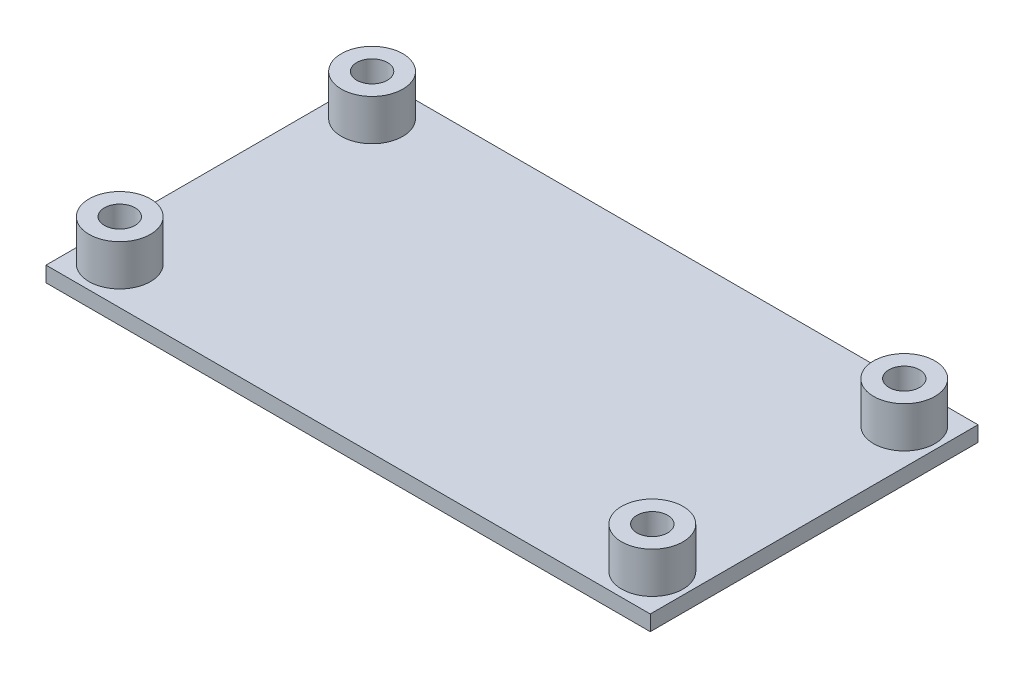
ISO-10303-21;
HEADER;
FILE_DESCRIPTION(('STEP AP214'),'2;1');
FILE_NAME('part.step','',(''),(''),'','','');
FILE_SCHEMA(('AUTOMOTIVE_DESIGN { 1 0 10303 214 1 1 1 1 }'));
ENDSEC;
DATA;
#1=APPLICATION_CONTEXT('core data for automotive mechanical design processes');
#2=APPLICATION_PROTOCOL_DEFINITION('international standard','automotive_design',2000,#1);
#3=PRODUCT_CONTEXT('',#1,'mechanical');
#4=PRODUCT('Part','Part','',(#3));
#5=PRODUCT_RELATED_PRODUCT_CATEGORY('part','',(#4));
#6=PRODUCT_DEFINITION_FORMATION('','',#4);
#7=PRODUCT_DEFINITION_CONTEXT('part definition',#1,'design');
#8=PRODUCT_DEFINITION('design','',#6,#7);
#9=PRODUCT_DEFINITION_SHAPE('','',#8);
#10=(LENGTH_UNIT() NAMED_UNIT(*) SI_UNIT(.MILLI.,.METRE.));
#11=(NAMED_UNIT(*) PLANE_ANGLE_UNIT() SI_UNIT($,.RADIAN.));
#12=(NAMED_UNIT(*) SI_UNIT($,.STERADIAN.) SOLID_ANGLE_UNIT());
#13=UNCERTAINTY_MEASURE_WITH_UNIT(LENGTH_MEASURE(1.E-05),#10,'distance_accuracy_value','');
#14=(GEOMETRIC_REPRESENTATION_CONTEXT(3) GLOBAL_UNCERTAINTY_ASSIGNED_CONTEXT((#13)) GLOBAL_UNIT_ASSIGNED_CONTEXT((#10,
#11,#12)) REPRESENTATION_CONTEXT('',''));
#15=CARTESIAN_POINT('',(0.,0.,0.));
#16=DIRECTION('',(0.,0.,1.));
#17=DIRECTION('',(1.,0.,0.));
#18=AXIS2_PLACEMENT_3D('',#15,#16,#17);
#19=CARTESIAN_POINT('',(0.,1.5,0.));
#20=DIRECTION('',(0.,1.,0.));
#21=DIRECTION('',(0.,0.,1.));
#22=AXIS2_PLACEMENT_3D('',#19,#20,#21);
#23=PLANE('',#22);
#24=DIRECTION('',(0.,0.,-1.));
#25=VECTOR('',#24,1.);
#26=CARTESIAN_POINT('',(33.3618988565565,1.5,-11.4656738072446));
#27=LINE('',#26,#25);
#28=CARTESIAN_POINT('',(33.3618988565565,1.5,20.5343261927554));
#29=VERTEX_POINT('',#28);
#30=CARTESIAN_POINT('',(33.3618988565565,1.5,-11.4656738072446));
#31=VERTEX_POINT('',#30);
#32=EDGE_CURVE('E81',#29,#31,#27,.T.);
#33=ORIENTED_EDGE('',*,*,#32,.T.);
#34=DIRECTION('',(1.,0.,0.));
#35=VECTOR('',#34,1.);
#36=CARTESIAN_POINT('',(-24.6381011434435,1.5,-11.4656738072446));
#37=LINE('',#36,#35);
#38=CARTESIAN_POINT('',(-25.6381011434435,1.5,-11.4656738072446));
#39=VERTEX_POINT('',#38);
#40=EDGE_CURVE('E111',#39,#31,#37,.T.);
#41=ORIENTED_EDGE('',*,*,#40,.F.);
#42=DIRECTION('',(0.,0.,1.));
#43=VECTOR('',#42,1.);
#44=CARTESIAN_POINT('',(-25.6381011434435,1.5,-11.4656738072446));
#45=LINE('',#44,#43);
#46=CARTESIAN_POINT('',(-25.6381011434435,1.5,20.5343261927554));
#47=VERTEX_POINT('',#46);
#48=EDGE_CURVE('E83',#39,#47,#45,.T.);
#49=ORIENTED_EDGE('',*,*,#48,.T.);
#50=DIRECTION('',(-1.,0.,0.));
#51=VECTOR('',#50,1.);
#52=CARTESIAN_POINT('',(-24.6381011434435,1.5,20.5343261927554));
#53=LINE('',#52,#51);
#54=EDGE_CURVE('E77',#29,#47,#53,.T.);
#55=ORIENTED_EDGE('',*,*,#54,.F.);
#56=EDGE_LOOP('',(#33,#41,#49,#55));
#57=FACE_BOUND('',#56,.T.);
#58=CARTESIAN_POINT('',(29.8618988565565,1.5,-7.76567380724461));
#59=DIRECTION('',(0.,1.,0.));
#60=DIRECTION('',(0.,0.,1.));
#61=AXIS2_PLACEMENT_3D('',#58,#59,#60);
#62=CIRCLE('',#61,3.);
#63=CARTESIAN_POINT('',(29.8618988565565,1.5,-4.76567380724461));
#64=VERTEX_POINT('',#63);
#65=EDGE_CURVE('E152',#64,#64,#62,.F.);
#66=ORIENTED_EDGE('',*,*,#65,.T.);
#67=EDGE_LOOP('',(#66));
#68=FACE_BOUND('',#67,.T.);
#69=CARTESIAN_POINT('',(29.8618988565565,1.5,16.8343261927554));
#70=DIRECTION('',(0.,1.,0.));
#71=DIRECTION('',(0.,0.,1.));
#72=AXIS2_PLACEMENT_3D('',#69,#70,#71);
#73=CIRCLE('',#72,3.);
#74=CARTESIAN_POINT('',(29.8618988565565,1.5,19.8343261927554));
#75=VERTEX_POINT('',#74);
#76=EDGE_CURVE('E11',#75,#75,#73,.F.);
#77=ORIENTED_EDGE('',*,*,#76,.T.);
#78=EDGE_LOOP('',(#77));
#79=FACE_BOUND('',#78,.T.);
#80=CARTESIAN_POINT('',(-22.1381011434435,1.5,16.8343261927554));
#81=DIRECTION('',(0.,1.,0.));
#82=DIRECTION('',(0.,0.,1.));
#83=AXIS2_PLACEMENT_3D('',#80,#81,#82);
#84=CIRCLE('',#83,3.);
#85=CARTESIAN_POINT('',(-22.1381011434435,1.5,19.8343261927554));
#86=VERTEX_POINT('',#85);
#87=EDGE_CURVE('E146',#86,#86,#84,.F.);
#88=ORIENTED_EDGE('',*,*,#87,.T.);
#89=EDGE_LOOP('',(#88));
#90=FACE_BOUND('',#89,.T.);
#91=CARTESIAN_POINT('',(-22.0993702767908,1.5,-7.76567380724461));
#92=DIRECTION('',(0.,1.,0.));
#93=DIRECTION('',(0.,0.,1.));
#94=AXIS2_PLACEMENT_3D('',#91,#92,#93);
#95=CIRCLE('',#94,3.);
#96=CARTESIAN_POINT('',(-22.0993702767908,1.5,-4.76567380724461));
#97=VERTEX_POINT('',#96);
#98=EDGE_CURVE('E140',#97,#97,#95,.T.);
#99=ORIENTED_EDGE('',*,*,#98,.F.);
#100=EDGE_LOOP('',(#99));
#101=FACE_BOUND('',#100,.T.);
#102=ADVANCED_FACE('F35',(#57,#68,#79,#90,#101),#23,.T.);
#103=CARTESIAN_POINT('',(0.,0.,0.));
#104=DIRECTION('',(0.,1.,0.));
#105=DIRECTION('',(0.,0.,1.));
#106=AXIS2_PLACEMENT_3D('',#103,#104,#105);
#107=PLANE('',#106);
#108=DIRECTION('',(-1.,0.,0.));
#109=VECTOR('',#108,1.);
#110=CARTESIAN_POINT('',(-24.6381011434435,0.,20.5343261927554));
#111=LINE('',#110,#109);
#112=CARTESIAN_POINT('',(33.3618988565565,0.,20.5343261927554));
#113=VERTEX_POINT('',#112);
#114=CARTESIAN_POINT('',(-25.6381011434435,0.,20.5343261927554));
#115=VERTEX_POINT('',#114);
#116=EDGE_CURVE('E57',#113,#115,#111,.T.);
#117=ORIENTED_EDGE('',*,*,#116,.T.);
#118=DIRECTION('',(0.,0.,-1.));
#119=VECTOR('',#118,1.);
#120=CARTESIAN_POINT('',(-25.6381011434435,0.,-11.4656738072446));
#121=LINE('',#120,#119);
#122=CARTESIAN_POINT('',(-25.6381011434435,0.,-11.4656738072446));
#123=VERTEX_POINT('',#122);
#124=EDGE_CURVE('E87',#115,#123,#121,.T.);
#125=ORIENTED_EDGE('',*,*,#124,.T.);
#126=DIRECTION('',(1.,0.,0.));
#127=VECTOR('',#126,1.);
#128=CARTESIAN_POINT('',(-24.6381011434435,0.,-11.4656738072446));
#129=LINE('',#128,#127);
#130=CARTESIAN_POINT('',(33.3618988565565,0.,-11.4656738072446));
#131=VERTEX_POINT('',#130);
#132=EDGE_CURVE('E50',#123,#131,#129,.T.);
#133=ORIENTED_EDGE('',*,*,#132,.T.);
#134=DIRECTION('',(0.,0.,1.));
#135=VECTOR('',#134,1.);
#136=CARTESIAN_POINT('',(33.3618988565565,0.,-11.4656738072446));
#137=LINE('',#136,#135);
#138=EDGE_CURVE('E101',#131,#113,#137,.T.);
#139=ORIENTED_EDGE('',*,*,#138,.T.);
#140=EDGE_LOOP('',(#117,#125,#133,#139));
#141=FACE_BOUND('',#140,.T.);
#142=ADVANCED_FACE('F37',(#141),#107,.F.);
#143=CARTESIAN_POINT('',(-22.0993702767908,5.5,-7.76567380724461));
#144=DIRECTION('',(0.,1.,0.));
#145=DIRECTION('',(0.,0.,1.));
#146=AXIS2_PLACEMENT_3D('',#143,#144,#145);
#147=PLANE('',#146);
#148=CARTESIAN_POINT('',(-22.0993702767908,5.5,-7.76567380724461));
#149=DIRECTION('',(0.,1.,0.));
#150=DIRECTION('',(0.,0.,1.));
#151=AXIS2_PLACEMENT_3D('',#148,#149,#150);
#152=CIRCLE('',#151,3.);
#153=CARTESIAN_POINT('',(-22.0993702767908,5.5,-4.76567380724461));
#154=VERTEX_POINT('',#153);
#155=EDGE_CURVE('E135',#154,#154,#152,.T.);
#156=ORIENTED_EDGE('',*,*,#155,.T.);
#157=EDGE_LOOP('',(#156));
#158=FACE_BOUND('',#157,.T.);
#159=CARTESIAN_POINT('',(-22.0993702767908,5.5,-7.76567380724461));
#160=DIRECTION('',(0.,1.,0.));
#161=DIRECTION('',(0.,0.,1.));
#162=AXIS2_PLACEMENT_3D('',#159,#160,#161);
#163=CIRCLE('',#162,1.5);
#164=CARTESIAN_POINT('',(-22.0993702767908,5.5,-6.26567380724461));
#165=VERTEX_POINT('',#164);
#166=EDGE_CURVE('E132',#165,#165,#163,.T.);
#167=ORIENTED_EDGE('',*,*,#166,.F.);
#168=EDGE_LOOP('',(#167));
#169=FACE_BOUND('',#168,.T.);
#170=ADVANCED_FACE('F182',(#158,#169),#147,.T.);
#171=CARTESIAN_POINT('',(-22.0993702767908,5.5,-7.76567380724461));
#172=DIRECTION('',(0.,-1.,0.));
#173=DIRECTION('',(0.,0.,-1.));
#174=AXIS2_PLACEMENT_3D('',#171,#172,#173);
#175=CYLINDRICAL_SURFACE('',#174,3.);
#176=ORIENTED_EDGE('',*,*,#155,.F.);
#177=EDGE_LOOP('',(#176));
#178=FACE_BOUND('',#177,.T.);
#179=ORIENTED_EDGE('',*,*,#98,.T.);
#180=EDGE_LOOP('',(#179));
#181=FACE_BOUND('',#180,.T.);
#182=ADVANCED_FACE('F194',(#178,#181),#175,.T.);
#183=CARTESIAN_POINT('',(-22.0993702767908,5.5,-7.76567380724461));
#184=DIRECTION('',(0.,-1.,0.));
#185=DIRECTION('',(0.,0.,-1.));
#186=AXIS2_PLACEMENT_3D('',#183,#184,#185);
#187=CYLINDRICAL_SURFACE('',#186,1.5);
#188=ORIENTED_EDGE('',*,*,#166,.T.);
#189=EDGE_LOOP('',(#188));
#190=FACE_BOUND('',#189,.T.);
#191=CARTESIAN_POINT('',(-22.0993702767908,1.5,-7.76567380724461));
#192=DIRECTION('',(0.,1.,0.));
#193=DIRECTION('',(0.,0.,1.));
#194=AXIS2_PLACEMENT_3D('',#191,#192,#193);
#195=CIRCLE('',#194,1.5);
#196=CARTESIAN_POINT('',(-22.0993702767908,1.5,-6.26567380724461));
#197=VERTEX_POINT('',#196);
#198=EDGE_CURVE('E131',#197,#197,#195,.T.);
#199=ORIENTED_EDGE('',*,*,#198,.F.);
#200=EDGE_LOOP('',(#199));
#201=FACE_BOUND('',#200,.T.);
#202=ADVANCED_FACE('F185',(#190,#201),#187,.F.);
#203=ORIENTED_EDGE('',*,*,#198,.T.);
#204=EDGE_LOOP('',(#203));
#205=FACE_BOUND('',#204,.T.);
#206=ADVANCED_FACE('F178',(#205),#23,.T.);
#207=CARTESIAN_POINT('',(-22.1381011434435,5.5,16.8343261927554));
#208=DIRECTION('',(0.,1.,0.));
#209=DIRECTION('',(0.,0.,1.));
#210=AXIS2_PLACEMENT_3D('',#207,#208,#209);
#211=PLANE('',#210);
#212=CARTESIAN_POINT('',(-22.1381011434435,5.5,16.8343261927554));
#213=DIRECTION('',(0.,1.,0.));
#214=DIRECTION('',(0.,0.,1.));
#215=AXIS2_PLACEMENT_3D('',#212,#213,#214);
#216=CIRCLE('',#215,3.);
#217=CARTESIAN_POINT('',(-22.1381011434435,5.5,19.8343261927554));
#218=VERTEX_POINT('',#217);
#219=EDGE_CURVE('E128',#218,#218,#216,.T.);
#220=ORIENTED_EDGE('',*,*,#219,.T.);
#221=EDGE_LOOP('',(#220));
#222=FACE_BOUND('',#221,.T.);
#223=CARTESIAN_POINT('',(-22.1381011434435,5.5,16.8343261927554));
#224=DIRECTION('',(0.,1.,0.));
#225=DIRECTION('',(0.,0.,1.));
#226=AXIS2_PLACEMENT_3D('',#223,#224,#225);
#227=CIRCLE('',#226,1.5);
#228=CARTESIAN_POINT('',(-22.1381011434435,5.5,18.3343261927554));
#229=VERTEX_POINT('',#228);
#230=EDGE_CURVE('E125',#229,#229,#227,.T.);
#231=ORIENTED_EDGE('',*,*,#230,.F.);
#232=EDGE_LOOP('',(#231));
#233=FACE_BOUND('',#232,.T.);
#234=ADVANCED_FACE('F184',(#222,#233),#211,.T.);
#235=CARTESIAN_POINT('',(-22.1381011434435,5.5,16.8343261927554));
#236=DIRECTION('',(0.,-1.,0.));
#237=DIRECTION('',(0.,0.,-1.));
#238=AXIS2_PLACEMENT_3D('',#235,#236,#237);
#239=CYLINDRICAL_SURFACE('',#238,3.);
#240=ORIENTED_EDGE('',*,*,#219,.F.);
#241=EDGE_LOOP('',(#240));
#242=FACE_BOUND('',#241,.T.);
#243=ORIENTED_EDGE('',*,*,#87,.F.);
#244=EDGE_LOOP('',(#243));
#245=FACE_BOUND('',#244,.T.);
#246=ADVANCED_FACE('F191',(#242,#245),#239,.T.);
#247=CARTESIAN_POINT('',(-22.1381011434435,5.5,16.8343261927554));
#248=DIRECTION('',(0.,-1.,0.));
#249=DIRECTION('',(0.,0.,-1.));
#250=AXIS2_PLACEMENT_3D('',#247,#248,#249);
#251=CYLINDRICAL_SURFACE('',#250,1.5);
#252=ORIENTED_EDGE('',*,*,#230,.T.);
#253=EDGE_LOOP('',(#252));
#254=FACE_BOUND('',#253,.T.);
#255=CARTESIAN_POINT('',(-22.1381011434435,1.5,16.8343261927554));
#256=DIRECTION('',(0.,1.,0.));
#257=DIRECTION('',(0.,0.,1.));
#258=AXIS2_PLACEMENT_3D('',#255,#256,#257);
#259=CIRCLE('',#258,1.5);
#260=CARTESIAN_POINT('',(-22.1381011434435,1.5,18.3343261927554));
#261=VERTEX_POINT('',#260);
#262=EDGE_CURVE('E143',#261,#261,#259,.F.);
#263=ORIENTED_EDGE('',*,*,#262,.T.);
#264=EDGE_LOOP('',(#263));
#265=FACE_BOUND('',#264,.T.);
#266=ADVANCED_FACE('F199',(#254,#265),#251,.F.);
#267=ORIENTED_EDGE('',*,*,#262,.F.);
#268=EDGE_LOOP('',(#267));
#269=FACE_BOUND('',#268,.T.);
#270=ADVANCED_FACE('F176',(#269),#23,.T.);
#271=CARTESIAN_POINT('',(29.8618988565565,5.5,-7.76567380724461));
#272=DIRECTION('',(0.,1.,0.));
#273=DIRECTION('',(0.,0.,1.));
#274=AXIS2_PLACEMENT_3D('',#271,#272,#273);
#275=PLANE('',#274);
#276=CARTESIAN_POINT('',(29.8618988565565,5.5,-7.76567380724461));
#277=DIRECTION('',(0.,1.,0.));
#278=DIRECTION('',(0.,0.,1.));
#279=AXIS2_PLACEMENT_3D('',#276,#277,#278);
#280=CIRCLE('',#279,3.);
#281=CARTESIAN_POINT('',(29.8618988565565,5.5,-4.76567380724461));
#282=VERTEX_POINT('',#281);
#283=EDGE_CURVE('E122',#282,#282,#280,.T.);
#284=ORIENTED_EDGE('',*,*,#283,.T.);
#285=EDGE_LOOP('',(#284));
#286=FACE_BOUND('',#285,.T.);
#287=CARTESIAN_POINT('',(29.8618988565565,5.5,-7.76567380724461));
#288=DIRECTION('',(0.,1.,0.));
#289=DIRECTION('',(0.,0.,1.));
#290=AXIS2_PLACEMENT_3D('',#287,#288,#289);
#291=CIRCLE('',#290,1.5);
#292=CARTESIAN_POINT('',(29.8618988565565,5.5,-6.26567380724461));
#293=VERTEX_POINT('',#292);
#294=EDGE_CURVE('E119',#293,#293,#291,.T.);
#295=ORIENTED_EDGE('',*,*,#294,.F.);
#296=EDGE_LOOP('',(#295));
#297=FACE_BOUND('',#296,.T.);
#298=ADVANCED_FACE('F198',(#286,#297),#275,.T.);
#299=CARTESIAN_POINT('',(29.8618988565565,5.5,-7.76567380724461));
#300=DIRECTION('',(0.,-1.,0.));
#301=DIRECTION('',(0.,0.,-1.));
#302=AXIS2_PLACEMENT_3D('',#299,#300,#301);
#303=CYLINDRICAL_SURFACE('',#302,3.);
#304=ORIENTED_EDGE('',*,*,#283,.F.);
#305=EDGE_LOOP('',(#304));
#306=FACE_BOUND('',#305,.T.);
#307=ORIENTED_EDGE('',*,*,#65,.F.);
#308=EDGE_LOOP('',(#307));
#309=FACE_BOUND('',#308,.T.);
#310=ADVANCED_FACE('F205',(#306,#309),#303,.T.);
#311=CARTESIAN_POINT('',(29.8618988565565,5.5,-7.76567380724461));
#312=DIRECTION('',(0.,-1.,0.));
#313=DIRECTION('',(0.,0.,-1.));
#314=AXIS2_PLACEMENT_3D('',#311,#312,#313);
#315=CYLINDRICAL_SURFACE('',#314,1.5);
#316=ORIENTED_EDGE('',*,*,#294,.T.);
#317=EDGE_LOOP('',(#316));
#318=FACE_BOUND('',#317,.T.);
#319=CARTESIAN_POINT('',(29.8618988565565,1.5,-7.76567380724461));
#320=DIRECTION('',(0.,1.,0.));
#321=DIRECTION('',(0.,0.,1.));
#322=AXIS2_PLACEMENT_3D('',#319,#320,#321);
#323=CIRCLE('',#322,1.5);
#324=CARTESIAN_POINT('',(29.8618988565565,1.5,-6.26567380724461));
#325=VERTEX_POINT('',#324);
#326=EDGE_CURVE('E149',#325,#325,#323,.F.);
#327=ORIENTED_EDGE('',*,*,#326,.T.);
#328=EDGE_LOOP('',(#327));
#329=FACE_BOUND('',#328,.T.);
#330=ADVANCED_FACE('F174',(#318,#329),#315,.F.);
#331=ORIENTED_EDGE('',*,*,#326,.F.);
#332=EDGE_LOOP('',(#331));
#333=FACE_BOUND('',#332,.T.);
#334=ADVANCED_FACE('F161',(#333),#23,.T.);
#335=CARTESIAN_POINT('',(29.8618988565565,5.5,16.8343261927554));
#336=DIRECTION('',(0.,1.,0.));
#337=DIRECTION('',(0.,0.,1.));
#338=AXIS2_PLACEMENT_3D('',#335,#336,#337);
#339=PLANE('',#338);
#340=CARTESIAN_POINT('',(29.8618988565565,5.5,16.8343261927554));
#341=DIRECTION('',(0.,1.,0.));
#342=DIRECTION('',(0.,0.,1.));
#343=AXIS2_PLACEMENT_3D('',#340,#341,#342);
#344=CIRCLE('',#343,3.);
#345=CARTESIAN_POINT('',(29.8618988565565,5.5,19.8343261927554));
#346=VERTEX_POINT('',#345);
#347=EDGE_CURVE('E116',#346,#346,#344,.T.);
#348=ORIENTED_EDGE('',*,*,#347,.T.);
#349=EDGE_LOOP('',(#348));
#350=FACE_BOUND('',#349,.T.);
#351=CARTESIAN_POINT('',(29.8618988565565,5.5,16.8343261927554));
#352=DIRECTION('',(0.,1.,0.));
#353=DIRECTION('',(0.,0.,1.));
#354=AXIS2_PLACEMENT_3D('',#351,#352,#353);
#355=CIRCLE('',#354,1.5);
#356=CARTESIAN_POINT('',(29.8618988565565,5.5,18.3343261927554));
#357=VERTEX_POINT('',#356);
#358=EDGE_CURVE('E110',#357,#357,#355,.T.);
#359=ORIENTED_EDGE('',*,*,#358,.F.);
#360=EDGE_LOOP('',(#359));
#361=FACE_BOUND('',#360,.T.);
#362=ADVANCED_FACE('F173',(#350,#361),#339,.T.);
#363=CARTESIAN_POINT('',(29.8618988565565,5.5,16.8343261927554));
#364=DIRECTION('',(0.,-1.,0.));
#365=DIRECTION('',(0.,0.,-1.));
#366=AXIS2_PLACEMENT_3D('',#363,#364,#365);
#367=CYLINDRICAL_SURFACE('',#366,3.);
#368=ORIENTED_EDGE('',*,*,#347,.F.);
#369=EDGE_LOOP('',(#368));
#370=FACE_BOUND('',#369,.T.);
#371=ORIENTED_EDGE('',*,*,#76,.F.);
#372=EDGE_LOOP('',(#371));
#373=FACE_BOUND('',#372,.T.);
#374=ADVANCED_FACE('F168',(#370,#373),#367,.T.);
#375=CARTESIAN_POINT('',(29.8618988565565,5.5,16.8343261927554));
#376=DIRECTION('',(0.,-1.,0.));
#377=DIRECTION('',(0.,0.,-1.));
#378=AXIS2_PLACEMENT_3D('',#375,#376,#377);
#379=CYLINDRICAL_SURFACE('',#378,1.5);
#380=ORIENTED_EDGE('',*,*,#358,.T.);
#381=EDGE_LOOP('',(#380));
#382=FACE_BOUND('',#381,.T.);
#383=CARTESIAN_POINT('',(29.8618988565565,1.5,16.8343261927554));
#384=DIRECTION('',(0.,1.,0.));
#385=DIRECTION('',(0.,0.,1.));
#386=AXIS2_PLACEMENT_3D('',#383,#384,#385);
#387=CIRCLE('',#386,1.5);
#388=CARTESIAN_POINT('',(29.8618988565565,1.5,18.3343261927554));
#389=VERTEX_POINT('',#388);
#390=EDGE_CURVE('E43',#389,#389,#387,.F.);
#391=ORIENTED_EDGE('',*,*,#390,.T.);
#392=EDGE_LOOP('',(#391));
#393=FACE_BOUND('',#392,.T.);
#394=ADVANCED_FACE('F157',(#382,#393),#379,.F.);
#395=ORIENTED_EDGE('',*,*,#390,.F.);
#396=EDGE_LOOP('',(#395));
#397=FACE_BOUND('',#396,.T.);
#398=ADVANCED_FACE('F159',(#397),#23,.T.);
#399=CARTESIAN_POINT('',(-24.6381011434435,0.,20.5343261927554));
#400=DIRECTION('',(0.,0.,-1.));
#401=DIRECTION('',(-1.,0.,0.));
#402=AXIS2_PLACEMENT_3D('',#399,#400,#401);
#403=PLANE('',#402);
#404=ORIENTED_EDGE('',*,*,#54,.T.);
#405=DIRECTION('',(0.,1.,0.));
#406=VECTOR('',#405,1.);
#407=CARTESIAN_POINT('',(-25.6381011434435,-32.0156211871642,20.5343261927554));
#408=LINE('',#407,#406);
#409=EDGE_CURVE('E106',#115,#47,#408,.T.);
#410=ORIENTED_EDGE('',*,*,#409,.F.);
#411=ORIENTED_EDGE('',*,*,#116,.F.);
#412=DIRECTION('',(0.,1.,0.));
#413=VECTOR('',#412,1.);
#414=CARTESIAN_POINT('',(33.3618988565565,-32.0156211871642,20.5343261927554));
#415=LINE('',#414,#413);
#416=EDGE_CURVE('E90',#113,#29,#415,.T.);
#417=ORIENTED_EDGE('',*,*,#416,.T.);
#418=EDGE_LOOP('',(#404,#410,#411,#417));
#419=FACE_BOUND('',#418,.T.);
#420=ADVANCED_FACE('F91',(#419),#403,.F.);
#421=CARTESIAN_POINT('',(-24.6381011434435,0.,-11.4656738072446));
#422=DIRECTION('',(0.,0.,1.));
#423=DIRECTION('',(1.,0.,0.));
#424=AXIS2_PLACEMENT_3D('',#421,#422,#423);
#425=PLANE('',#424);
#426=ORIENTED_EDGE('',*,*,#40,.T.);
#427=DIRECTION('',(0.,1.,0.));
#428=VECTOR('',#427,1.);
#429=CARTESIAN_POINT('',(33.3618988565565,-32.0156211871642,-11.4656738072446));
#430=LINE('',#429,#428);
#431=EDGE_CURVE('E94',#131,#31,#430,.T.);
#432=ORIENTED_EDGE('',*,*,#431,.F.);
#433=ORIENTED_EDGE('',*,*,#132,.F.);
#434=DIRECTION('',(0.,1.,0.));
#435=VECTOR('',#434,1.);
#436=CARTESIAN_POINT('',(-25.6381011434435,-32.0156211871642,-11.4656738072446));
#437=LINE('',#436,#435);
#438=EDGE_CURVE('E104',#123,#39,#437,.T.);
#439=ORIENTED_EDGE('',*,*,#438,.T.);
#440=EDGE_LOOP('',(#426,#432,#433,#439));
#441=FACE_BOUND('',#440,.T.);
#442=ADVANCED_FACE('F166',(#441),#425,.F.);
#443=CARTESIAN_POINT('',(-25.6381011434435,-32.0156211871642,-11.4656738072446));
#444=DIRECTION('',(-1.,0.,0.));
#445=DIRECTION('',(0.,0.,1.));
#446=AXIS2_PLACEMENT_3D('',#443,#444,#445);
#447=PLANE('',#446);
#448=ORIENTED_EDGE('',*,*,#124,.F.);
#449=ORIENTED_EDGE('',*,*,#409,.T.);
#450=ORIENTED_EDGE('',*,*,#48,.F.);
#451=ORIENTED_EDGE('',*,*,#438,.F.);
#452=EDGE_LOOP('',(#448,#449,#450,#451));
#453=FACE_BOUND('',#452,.T.);
#454=ADVANCED_FACE('F343',(#453),#447,.T.);
#455=CARTESIAN_POINT('',(33.3618988565565,-32.0156211871642,-11.4656738072446));
#456=DIRECTION('',(1.,0.,0.));
#457=DIRECTION('',(0.,0.,-1.));
#458=AXIS2_PLACEMENT_3D('',#455,#456,#457);
#459=PLANE('',#458);
#460=ORIENTED_EDGE('',*,*,#138,.F.);
#461=ORIENTED_EDGE('',*,*,#431,.T.);
#462=ORIENTED_EDGE('',*,*,#32,.F.);
#463=ORIENTED_EDGE('',*,*,#416,.F.);
#464=EDGE_LOOP('',(#460,#461,#462,#463));
#465=FACE_BOUND('',#464,.T.);
#466=ADVANCED_FACE('F97',(#465),#459,.T.);
#467=CLOSED_SHELL('',(#102,#142,#170,#182,#202,#206,#234,#246,#266,#270,#298,#310,#330,#334,
#362,#374,#394,#398,#420,#442,#454,#466));
#468=MANIFOLD_SOLID_BREP('B2',#467);
#469=ADVANCED_BREP_SHAPE_REPRESENTATION('',(#18,#468),#14);
#470=SHAPE_DEFINITION_REPRESENTATION(#9,#469);
ENDSEC;
END-ISO-10303-21;
